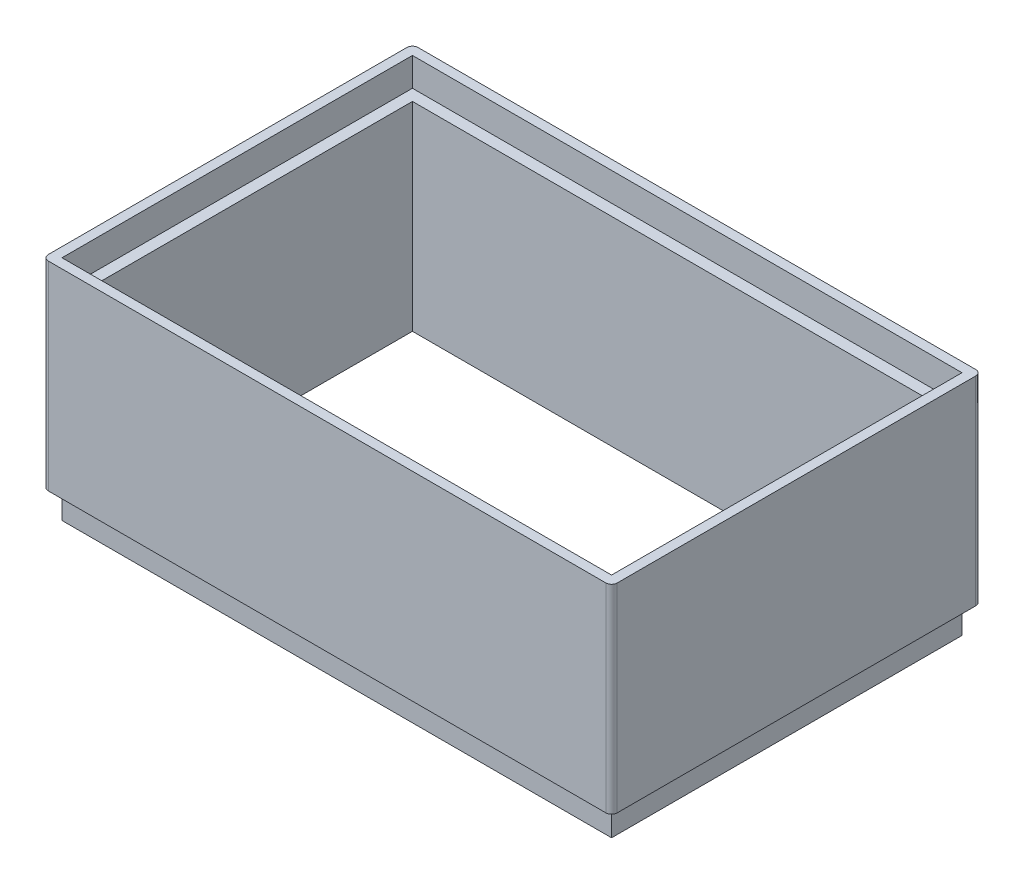
ISO-10303-21;
HEADER;
FILE_DESCRIPTION(('STEP AP214'),'2;1');
FILE_NAME('part.step','',(''),(''),'','','');
FILE_SCHEMA(('AUTOMOTIVE_DESIGN { 1 0 10303 214 1 1 1 1 }'));
ENDSEC;
DATA;
#1=APPLICATION_CONTEXT('core data for automotive mechanical design processes');
#2=APPLICATION_PROTOCOL_DEFINITION('international standard','automotive_design',2000,#1);
#3=PRODUCT_CONTEXT('',#1,'mechanical');
#4=PRODUCT('Part','Part','',(#3));
#5=PRODUCT_RELATED_PRODUCT_CATEGORY('part','',(#4));
#6=PRODUCT_DEFINITION_FORMATION('','',#4);
#7=PRODUCT_DEFINITION_CONTEXT('part definition',#1,'design');
#8=PRODUCT_DEFINITION('design','',#6,#7);
#9=PRODUCT_DEFINITION_SHAPE('','',#8);
#10=(LENGTH_UNIT() NAMED_UNIT(*) SI_UNIT(.MILLI.,.METRE.));
#11=(NAMED_UNIT(*) PLANE_ANGLE_UNIT() SI_UNIT($,.RADIAN.));
#12=(NAMED_UNIT(*) SI_UNIT($,.STERADIAN.) SOLID_ANGLE_UNIT());
#13=UNCERTAINTY_MEASURE_WITH_UNIT(LENGTH_MEASURE(1.E-05),#10,'distance_accuracy_value','');
#14=(GEOMETRIC_REPRESENTATION_CONTEXT(3) GLOBAL_UNCERTAINTY_ASSIGNED_CONTEXT((#13)) GLOBAL_UNIT_ASSIGNED_CONTEXT((#10,
#11,#12)) REPRESENTATION_CONTEXT('',''));
#15=CARTESIAN_POINT('',(0.,0.,0.));
#16=DIRECTION('',(0.,0.,1.));
#17=DIRECTION('',(1.,0.,0.));
#18=AXIS2_PLACEMENT_3D('',#15,#16,#17);
#19=CARTESIAN_POINT('',(47.5395437262358,80.002,-39.1555133079848));
#20=DIRECTION('',(0.,0.,-1.));
#21=DIRECTION('',(-1.,0.,0.));
#22=AXIS2_PLACEMENT_3D('',#19,#20,#21);
#23=PLANE('',#22);
#24=DIRECTION('',(1.,0.,0.));
#25=VECTOR('',#24,1.);
#26=CARTESIAN_POINT('',(47.5395437262358,70.,-39.1555133079848));
#27=LINE('',#26,#25);
#28=CARTESIAN_POINT('',(-45.0604562737642,70.,-39.1555133079848));
#29=VERTEX_POINT('',#28);
#30=CARTESIAN_POINT('',(47.5395437262358,70.,-39.1555133079848));
#31=VERTEX_POINT('',#30);
#32=EDGE_CURVE('E209',#29,#31,#27,.T.);
#33=ORIENTED_EDGE('',*,*,#32,.F.);
#34=DIRECTION('',(0.,-1.,0.));
#35=VECTOR('',#34,1.);
#36=CARTESIAN_POINT('',(-45.0604562737642,80.002,-39.1555133079848));
#37=LINE('',#36,#35);
#38=CARTESIAN_POINT('',(-45.0604562737642,35.,-39.1555133079848));
#39=VERTEX_POINT('',#38);
#40=EDGE_CURVE('E318',#29,#39,#37,.T.);
#41=ORIENTED_EDGE('',*,*,#40,.T.);
#42=DIRECTION('',(1.,0.,0.));
#43=VECTOR('',#42,1.);
#44=CARTESIAN_POINT('',(47.5395437262358,35.,-39.1555133079848));
#45=LINE('',#44,#43);
#46=CARTESIAN_POINT('',(47.5395437262358,35.,-39.1555133079848));
#47=VERTEX_POINT('',#46);
#48=EDGE_CURVE('E263',#39,#47,#45,.T.);
#49=ORIENTED_EDGE('',*,*,#48,.T.);
#50=DIRECTION('',(0.,-1.,0.));
#51=VECTOR('',#50,1.);
#52=CARTESIAN_POINT('',(47.5395437262358,80.002,-39.1555133079848));
#53=LINE('',#52,#51);
#54=EDGE_CURVE('E235',#31,#47,#53,.T.);
#55=ORIENTED_EDGE('',*,*,#54,.F.);
#56=EDGE_LOOP('',(#33,#41,#49,#55));
#57=FACE_BOUND('',#56,.T.);
#58=ADVANCED_FACE('F32',(#57),#23,.F.);
#59=CARTESIAN_POINT('',(-45.0604562737642,80.002,-39.1555133079848));
#60=DIRECTION('',(-1.,0.,0.));
#61=DIRECTION('',(0.,0.,1.));
#62=AXIS2_PLACEMENT_3D('',#59,#60,#61);
#63=PLANE('',#62);
#64=DIRECTION('',(0.,0.,-1.));
#65=VECTOR('',#64,1.);
#66=CARTESIAN_POINT('',(-45.0604562737642,70.,-39.1555133079848));
#67=LINE('',#66,#65);
#68=CARTESIAN_POINT('',(-45.0604562737642,70.,18.4444866920152));
#69=VERTEX_POINT('',#68);
#70=EDGE_CURVE('E207',#69,#29,#67,.T.);
#71=ORIENTED_EDGE('',*,*,#70,.F.);
#72=DIRECTION('',(0.,-1.,0.));
#73=VECTOR('',#72,1.);
#74=CARTESIAN_POINT('',(-45.0604562737642,80.002,18.4444866920152));
#75=LINE('',#74,#73);
#76=CARTESIAN_POINT('',(-45.0604562737642,35.,18.4444866920152));
#77=VERTEX_POINT('',#76);
#78=EDGE_CURVE('E320',#69,#77,#75,.T.);
#79=ORIENTED_EDGE('',*,*,#78,.T.);
#80=DIRECTION('',(0.,0.,-1.));
#81=VECTOR('',#80,1.);
#82=CARTESIAN_POINT('',(-45.0604562737642,35.,-39.1555133079848));
#83=LINE('',#82,#81);
#84=EDGE_CURVE('E273',#77,#39,#83,.T.);
#85=ORIENTED_EDGE('',*,*,#84,.T.);
#86=ORIENTED_EDGE('',*,*,#40,.F.);
#87=EDGE_LOOP('',(#71,#79,#85,#86));
#88=FACE_BOUND('',#87,.T.);
#89=ADVANCED_FACE('F337',(#88),#63,.F.);
#90=CARTESIAN_POINT('',(47.5395437262358,80.002,-39.1555133079848));
#91=DIRECTION('',(1.,0.,0.));
#92=DIRECTION('',(0.,0.,-1.));
#93=AXIS2_PLACEMENT_3D('',#90,#91,#92);
#94=PLANE('',#93);
#95=DIRECTION('',(0.,0.,1.));
#96=VECTOR('',#95,1.);
#97=CARTESIAN_POINT('',(47.5395437262358,70.,-39.1555133079848));
#98=LINE('',#97,#96);
#99=CARTESIAN_POINT('',(47.5395437262358,70.,18.4444866920152));
#100=VERTEX_POINT('',#99);
#101=EDGE_CURVE('E54',#31,#100,#98,.T.);
#102=ORIENTED_EDGE('',*,*,#101,.F.);
#103=ORIENTED_EDGE('',*,*,#54,.T.);
#104=DIRECTION('',(0.,0.,1.));
#105=VECTOR('',#104,1.);
#106=CARTESIAN_POINT('',(47.5395437262358,35.,-39.1555133079848));
#107=LINE('',#106,#105);
#108=CARTESIAN_POINT('',(47.5395437262358,35.,18.4444866920152));
#109=VERTEX_POINT('',#108);
#110=EDGE_CURVE('E40',#47,#109,#107,.T.);
#111=ORIENTED_EDGE('',*,*,#110,.T.);
#112=DIRECTION('',(0.,-1.,0.));
#113=VECTOR('',#112,1.);
#114=CARTESIAN_POINT('',(47.5395437262358,80.002,18.4444866920152));
#115=LINE('',#114,#113);
#116=EDGE_CURVE('E240',#100,#109,#115,.T.);
#117=ORIENTED_EDGE('',*,*,#116,.F.);
#118=EDGE_LOOP('',(#102,#103,#111,#117));
#119=FACE_BOUND('',#118,.T.);
#120=ADVANCED_FACE('F329',(#119),#94,.F.);
#121=CARTESIAN_POINT('',(47.5395437262358,80.002,18.4444866920152));
#122=DIRECTION('',(0.,0.,1.));
#123=DIRECTION('',(1.,0.,0.));
#124=AXIS2_PLACEMENT_3D('',#121,#122,#123);
#125=PLANE('',#124);
#126=DIRECTION('',(-1.,0.,0.));
#127=VECTOR('',#126,1.);
#128=CARTESIAN_POINT('',(47.5395437262358,70.,18.4444866920152));
#129=LINE('',#128,#127);
#130=EDGE_CURVE('E11',#100,#69,#129,.T.);
#131=ORIENTED_EDGE('',*,*,#130,.F.);
#132=ORIENTED_EDGE('',*,*,#116,.T.);
#133=DIRECTION('',(-1.,0.,0.));
#134=VECTOR('',#133,1.);
#135=CARTESIAN_POINT('',(47.5395437262358,35.,18.4444866920152));
#136=LINE('',#135,#134);
#137=EDGE_CURVE('E276',#109,#77,#136,.T.);
#138=ORIENTED_EDGE('',*,*,#137,.T.);
#139=ORIENTED_EDGE('',*,*,#78,.F.);
#140=EDGE_LOOP('',(#131,#132,#138,#139));
#141=FACE_BOUND('',#140,.T.);
#142=ADVANCED_FACE('F323',(#141),#125,.F.);
#143=CARTESIAN_POINT('',(0.,75.,0.));
#144=DIRECTION('',(0.,1.,0.));
#145=DIRECTION('',(0.,0.,1.));
#146=AXIS2_PLACEMENT_3D('',#143,#144,#145);
#147=PLANE('',#146);
#148=DIRECTION('',(0.,0.,1.));
#149=VECTOR('',#148,1.);
#150=CARTESIAN_POINT('',(-47.0604562737643,75.,-41.1555133079848));
#151=LINE('',#150,#149);
#152=CARTESIAN_POINT('',(-47.0604562737643,75.,-41.1555133079848));
#153=VERTEX_POINT('',#152);
#154=CARTESIAN_POINT('',(-47.0604562737643,75.,20.4444866920152));
#155=VERTEX_POINT('',#154);
#156=EDGE_CURVE('E47',#153,#155,#151,.T.);
#157=ORIENTED_EDGE('',*,*,#156,.F.);
#158=DIRECTION('',(-1.,0.,0.));
#159=VECTOR('',#158,1.);
#160=CARTESIAN_POINT('',(-47.0604562737643,75.,-41.1555133079848));
#161=LINE('',#160,#159);
#162=CARTESIAN_POINT('',(49.5395437262358,75.,-41.1555133079848));
#163=VERTEX_POINT('',#162);
#164=EDGE_CURVE('E188',#163,#153,#161,.T.);
#165=ORIENTED_EDGE('',*,*,#164,.F.);
#166=DIRECTION('',(0.,0.,-1.));
#167=VECTOR('',#166,1.);
#168=CARTESIAN_POINT('',(49.5395437262358,75.,-41.1555133079848));
#169=LINE('',#168,#167);
#170=CARTESIAN_POINT('',(49.5395437262358,75.,20.4444866920152));
#171=VERTEX_POINT('',#170);
#172=EDGE_CURVE('E191',#171,#163,#169,.T.);
#173=ORIENTED_EDGE('',*,*,#172,.F.);
#174=DIRECTION('',(1.,0.,0.));
#175=VECTOR('',#174,1.);
#176=CARTESIAN_POINT('',(-47.0604562737643,75.,20.4444866920152));
#177=LINE('',#176,#175);
#178=EDGE_CURVE('E197',#155,#171,#177,.T.);
#179=ORIENTED_EDGE('',*,*,#178,.F.);
#180=EDGE_LOOP('',(#157,#165,#173,#179));
#181=FACE_BOUND('',#180,.T.);
#182=CARTESIAN_POINT('',(-47.7604562737643,75.,21.1444866920152));
#183=DIRECTION('',(0.,1.,0.));
#184=DIRECTION('',(0.,0.,1.));
#185=AXIS2_PLACEMENT_3D('',#182,#183,#184);
#186=CIRCLE('',#185,1.);
#187=CARTESIAN_POINT('',(-47.7604562737643,75.,22.1444866920152));
#188=VERTEX_POINT('',#187);
#189=CARTESIAN_POINT('',(-48.7604562737643,75.,21.1444866920152));
#190=VERTEX_POINT('',#189);
#191=EDGE_CURVE('E286',#188,#190,#186,.F.);
#192=ORIENTED_EDGE('',*,*,#191,.F.);
#193=DIRECTION('',(1.,0.,0.));
#194=VECTOR('',#193,1.);
#195=CARTESIAN_POINT('',(-48.7604562737643,75.,22.1444866920152));
#196=LINE('',#195,#194);
#197=CARTESIAN_POINT('',(50.2395437262358,75.,22.1444866920152));
#198=VERTEX_POINT('',#197);
#199=EDGE_CURVE('E288',#188,#198,#196,.T.);
#200=ORIENTED_EDGE('',*,*,#199,.T.);
#201=CARTESIAN_POINT('',(50.2395437262358,75.,21.1444866920152));
#202=DIRECTION('',(0.,1.,0.));
#203=DIRECTION('',(0.,0.,1.));
#204=AXIS2_PLACEMENT_3D('',#201,#202,#203);
#205=CIRCLE('',#204,1.);
#206=CARTESIAN_POINT('',(51.2395437262358,75.,21.1444866920152));
#207=VERTEX_POINT('',#206);
#208=EDGE_CURVE('E282',#207,#198,#205,.F.);
#209=ORIENTED_EDGE('',*,*,#208,.F.);
#210=DIRECTION('',(0.,0.,-1.));
#211=VECTOR('',#210,1.);
#212=CARTESIAN_POINT('',(51.2395437262357,75.,-42.8555133079848));
#213=LINE('',#212,#211);
#214=CARTESIAN_POINT('',(51.2395437262357,75.,-41.8555133079848));
#215=VERTEX_POINT('',#214);
#216=EDGE_CURVE('E294',#207,#215,#213,.T.);
#217=ORIENTED_EDGE('',*,*,#216,.T.);
#218=CARTESIAN_POINT('',(50.2395437262357,75.,-41.8555133079848));
#219=DIRECTION('',(0.,1.,0.));
#220=DIRECTION('',(0.,0.,1.));
#221=AXIS2_PLACEMENT_3D('',#218,#219,#220);
#222=CIRCLE('',#221,1.);
#223=CARTESIAN_POINT('',(50.2395437262357,75.,-42.8555133079848));
#224=VERTEX_POINT('',#223);
#225=EDGE_CURVE('E215',#224,#215,#222,.F.);
#226=ORIENTED_EDGE('',*,*,#225,.F.);
#227=DIRECTION('',(-1.,0.,0.));
#228=VECTOR('',#227,1.);
#229=CARTESIAN_POINT('',(-48.7604562737643,75.,-42.8555133079848));
#230=LINE('',#229,#228);
#231=CARTESIAN_POINT('',(-47.7604562737643,75.,-42.8555133079848));
#232=VERTEX_POINT('',#231);
#233=EDGE_CURVE('E211',#224,#232,#230,.T.);
#234=ORIENTED_EDGE('',*,*,#233,.T.);
#235=CARTESIAN_POINT('',(-47.7604562737643,75.,-41.8555133079848));
#236=DIRECTION('',(0.,1.,0.));
#237=DIRECTION('',(0.,0.,1.));
#238=AXIS2_PLACEMENT_3D('',#235,#236,#237);
#239=CIRCLE('',#238,1.);
#240=CARTESIAN_POINT('',(-48.7604562737643,75.,-41.8555133079848));
#241=VERTEX_POINT('',#240);
#242=EDGE_CURVE('E284',#241,#232,#239,.F.);
#243=ORIENTED_EDGE('',*,*,#242,.F.);
#244=DIRECTION('',(0.,0.,1.));
#245=VECTOR('',#244,1.);
#246=CARTESIAN_POINT('',(-48.7604562737643,75.,-42.8555133079848));
#247=LINE('',#246,#245);
#248=EDGE_CURVE('E291',#241,#190,#247,.T.);
#249=ORIENTED_EDGE('',*,*,#248,.T.);
#250=EDGE_LOOP('',(#192,#200,#209,#217,#226,#234,#243,#249));
#251=FACE_BOUND('',#250,.T.);
#252=ADVANCED_FACE('F351',(#181,#251),#147,.T.);
#253=CARTESIAN_POINT('',(-47.0604562737643,35.,-41.1555133079848));
#254=DIRECTION('',(0.,0.,1.));
#255=DIRECTION('',(1.,0.,0.));
#256=AXIS2_PLACEMENT_3D('',#253,#254,#255);
#257=PLANE('',#256);
#258=DIRECTION('',(1.,0.,0.));
#259=VECTOR('',#258,1.);
#260=CARTESIAN_POINT('',(-47.0604562737643,40.,-41.1555133079848));
#261=LINE('',#260,#259);
#262=CARTESIAN_POINT('',(-47.0604562737643,40.,-41.1555133079848));
#263=VERTEX_POINT('',#262);
#264=CARTESIAN_POINT('',(49.5395437262358,40.,-41.1555133079848));
#265=VERTEX_POINT('',#264);
#266=EDGE_CURVE('E257',#263,#265,#261,.T.);
#267=ORIENTED_EDGE('',*,*,#266,.T.);
#268=DIRECTION('',(0.,1.,0.));
#269=VECTOR('',#268,1.);
#270=CARTESIAN_POINT('',(49.5395437262358,35.,-41.1555133079848));
#271=LINE('',#270,#269);
#272=CARTESIAN_POINT('',(49.5395437262358,35.,-41.1555133079848));
#273=VERTEX_POINT('',#272);
#274=EDGE_CURVE('E239',#273,#265,#271,.T.);
#275=ORIENTED_EDGE('',*,*,#274,.F.);
#276=DIRECTION('',(1.,0.,0.));
#277=VECTOR('',#276,1.);
#278=CARTESIAN_POINT('',(-47.0604562737643,35.,-41.1555133079848));
#279=LINE('',#278,#277);
#280=CARTESIAN_POINT('',(-47.0604562737643,35.,-41.1555133079848));
#281=VERTEX_POINT('',#280);
#282=EDGE_CURVE('E267',#281,#273,#279,.T.);
#283=ORIENTED_EDGE('',*,*,#282,.F.);
#284=DIRECTION('',(0.,1.,0.));
#285=VECTOR('',#284,1.);
#286=CARTESIAN_POINT('',(-47.0604562737643,35.,-41.1555133079848));
#287=LINE('',#286,#285);
#288=EDGE_CURVE('E236',#281,#263,#287,.T.);
#289=ORIENTED_EDGE('',*,*,#288,.T.);
#290=EDGE_LOOP('',(#267,#275,#283,#289));
#291=FACE_BOUND('',#290,.T.);
#292=ADVANCED_FACE('F352',(#291),#257,.F.);
#293=CARTESIAN_POINT('',(49.5395437262358,35.,20.4444866920152));
#294=DIRECTION('',(-1.,0.,0.));
#295=DIRECTION('',(0.,0.,1.));
#296=AXIS2_PLACEMENT_3D('',#293,#294,#295);
#297=PLANE('',#296);
#298=DIRECTION('',(0.,0.,1.));
#299=VECTOR('',#298,1.);
#300=CARTESIAN_POINT('',(49.5395437262358,40.,20.4444866920152));
#301=LINE('',#300,#299);
#302=CARTESIAN_POINT('',(49.5395437262358,40.,20.4444866920152));
#303=VERTEX_POINT('',#302);
#304=EDGE_CURVE('E253',#265,#303,#301,.T.);
#305=ORIENTED_EDGE('',*,*,#304,.T.);
#306=DIRECTION('',(0.,1.,0.));
#307=VECTOR('',#306,1.);
#308=CARTESIAN_POINT('',(49.5395437262358,35.,20.4444866920152));
#309=LINE('',#308,#307);
#310=CARTESIAN_POINT('',(49.5395437262358,35.,20.4444866920152));
#311=VERTEX_POINT('',#310);
#312=EDGE_CURVE('E243',#311,#303,#309,.T.);
#313=ORIENTED_EDGE('',*,*,#312,.F.);
#314=DIRECTION('',(0.,0.,1.));
#315=VECTOR('',#314,1.);
#316=CARTESIAN_POINT('',(49.5395437262358,35.,20.4444866920152));
#317=LINE('',#316,#315);
#318=EDGE_CURVE('E265',#273,#311,#317,.T.);
#319=ORIENTED_EDGE('',*,*,#318,.F.);
#320=ORIENTED_EDGE('',*,*,#274,.T.);
#321=EDGE_LOOP('',(#305,#313,#319,#320));
#322=FACE_BOUND('',#321,.T.);
#323=ADVANCED_FACE('F419',(#322),#297,.F.);
#324=CARTESIAN_POINT('',(-47.0604562737643,35.,20.4444866920152));
#325=DIRECTION('',(0.,0.,-1.));
#326=DIRECTION('',(-1.,0.,0.));
#327=AXIS2_PLACEMENT_3D('',#324,#325,#326);
#328=PLANE('',#327);
#329=DIRECTION('',(-1.,0.,0.));
#330=VECTOR('',#329,1.);
#331=CARTESIAN_POINT('',(-47.0604562737643,40.,20.4444866920152));
#332=LINE('',#331,#330);
#333=CARTESIAN_POINT('',(-47.0604562737643,40.,20.4444866920152));
#334=VERTEX_POINT('',#333);
#335=EDGE_CURVE('E250',#303,#334,#332,.T.);
#336=ORIENTED_EDGE('',*,*,#335,.T.);
#337=DIRECTION('',(0.,1.,0.));
#338=VECTOR('',#337,1.);
#339=CARTESIAN_POINT('',(-47.0604562737643,35.,20.4444866920152));
#340=LINE('',#339,#338);
#341=CARTESIAN_POINT('',(-47.0604562737643,35.,20.4444866920152));
#342=VERTEX_POINT('',#341);
#343=EDGE_CURVE('E246',#342,#334,#340,.T.);
#344=ORIENTED_EDGE('',*,*,#343,.F.);
#345=DIRECTION('',(-1.,0.,0.));
#346=VECTOR('',#345,1.);
#347=CARTESIAN_POINT('',(-47.0604562737643,35.,20.4444866920152));
#348=LINE('',#347,#346);
#349=EDGE_CURVE('E249',#311,#342,#348,.T.);
#350=ORIENTED_EDGE('',*,*,#349,.F.);
#351=ORIENTED_EDGE('',*,*,#312,.T.);
#352=EDGE_LOOP('',(#336,#344,#350,#351));
#353=FACE_BOUND('',#352,.T.);
#354=ADVANCED_FACE('F416',(#353),#328,.F.);
#355=CARTESIAN_POINT('',(-47.0604562737643,35.,20.4444866920152));
#356=DIRECTION('',(1.,0.,0.));
#357=DIRECTION('',(0.,0.,-1.));
#358=AXIS2_PLACEMENT_3D('',#355,#356,#357);
#359=PLANE('',#358);
#360=DIRECTION('',(0.,0.,-1.));
#361=VECTOR('',#360,1.);
#362=CARTESIAN_POINT('',(-47.0604562737643,40.,20.4444866920152));
#363=LINE('',#362,#361);
#364=EDGE_CURVE('E260',#334,#263,#363,.T.);
#365=ORIENTED_EDGE('',*,*,#364,.T.);
#366=ORIENTED_EDGE('',*,*,#288,.F.);
#367=DIRECTION('',(0.,0.,-1.));
#368=VECTOR('',#367,1.);
#369=CARTESIAN_POINT('',(-47.0604562737643,35.,20.4444866920152));
#370=LINE('',#369,#368);
#371=EDGE_CURVE('E254',#342,#281,#370,.T.);
#372=ORIENTED_EDGE('',*,*,#371,.F.);
#373=ORIENTED_EDGE('',*,*,#343,.T.);
#374=EDGE_LOOP('',(#365,#366,#372,#373));
#375=FACE_BOUND('',#374,.T.);
#376=ADVANCED_FACE('F409',(#375),#359,.F.);
#377=CARTESIAN_POINT('',(-48.7604562737643,80.,22.1444866920152));
#378=DIRECTION('',(0.,0.,-1.));
#379=DIRECTION('',(-1.,0.,0.));
#380=AXIS2_PLACEMENT_3D('',#377,#378,#379);
#381=PLANE('',#380);
#382=ORIENTED_EDGE('',*,*,#199,.F.);
#383=DIRECTION('',(0.,-1.,0.));
#384=VECTOR('',#383,1.);
#385=CARTESIAN_POINT('',(-47.7604562737643,80.,22.1444866920152));
#386=LINE('',#385,#384);
#387=CARTESIAN_POINT('',(-47.7604562737643,40.,22.1444866920152));
#388=VERTEX_POINT('',#387);
#389=EDGE_CURVE('E301',#188,#388,#386,.T.);
#390=ORIENTED_EDGE('',*,*,#389,.T.);
#391=DIRECTION('',(1.,0.,0.));
#392=VECTOR('',#391,1.);
#393=CARTESIAN_POINT('',(-48.7604562737643,40.,22.1444866920152));
#394=LINE('',#393,#392);
#395=CARTESIAN_POINT('',(50.2395437262358,40.,22.1444866920152));
#396=VERTEX_POINT('',#395);
#397=EDGE_CURVE('E225',#388,#396,#394,.T.);
#398=ORIENTED_EDGE('',*,*,#397,.T.);
#399=DIRECTION('',(0.,-1.,0.));
#400=VECTOR('',#399,1.);
#401=CARTESIAN_POINT('',(50.2395437262358,80.,22.1444866920152));
#402=LINE('',#401,#400);
#403=EDGE_CURVE('E221',#396,#198,#402,.F.);
#404=ORIENTED_EDGE('',*,*,#403,.T.);
#405=EDGE_LOOP('',(#382,#390,#398,#404));
#406=FACE_BOUND('',#405,.T.);
#407=ADVANCED_FACE('F392',(#406),#381,.F.);
#408=CARTESIAN_POINT('',(0.,40.,0.));
#409=DIRECTION('',(0.,1.,0.));
#410=DIRECTION('',(0.,0.,1.));
#411=AXIS2_PLACEMENT_3D('',#408,#409,#410);
#412=PLANE('',#411);
#413=DIRECTION('',(0.,0.,-1.));
#414=VECTOR('',#413,1.);
#415=CARTESIAN_POINT('',(51.2395437262357,40.,-42.8555133079848));
#416=LINE('',#415,#414);
#417=CARTESIAN_POINT('',(51.2395437262358,40.,21.1444866920152));
#418=VERTEX_POINT('',#417);
#419=CARTESIAN_POINT('',(51.2395437262357,40.,-41.8555133079848));
#420=VERTEX_POINT('',#419);
#421=EDGE_CURVE('E229',#418,#420,#416,.T.);
#422=ORIENTED_EDGE('',*,*,#421,.F.);
#423=CARTESIAN_POINT('',(50.2395437262358,40.,21.1444866920152));
#424=DIRECTION('',(0.,1.,0.));
#425=DIRECTION('',(0.,0.,1.));
#426=AXIS2_PLACEMENT_3D('',#423,#424,#425);
#427=CIRCLE('',#426,1.);
#428=EDGE_CURVE('E212',#418,#396,#427,.F.);
#429=ORIENTED_EDGE('',*,*,#428,.T.);
#430=ORIENTED_EDGE('',*,*,#397,.F.);
#431=CARTESIAN_POINT('',(-47.7604562737643,40.,21.1444866920152));
#432=DIRECTION('',(0.,1.,0.));
#433=DIRECTION('',(0.,0.,1.));
#434=AXIS2_PLACEMENT_3D('',#431,#432,#433);
#435=CIRCLE('',#434,1.);
#436=CARTESIAN_POINT('',(-48.7604562737643,40.,21.1444866920152));
#437=VERTEX_POINT('',#436);
#438=EDGE_CURVE('E214',#388,#437,#435,.F.);
#439=ORIENTED_EDGE('',*,*,#438,.T.);
#440=DIRECTION('',(0.,0.,1.));
#441=VECTOR('',#440,1.);
#442=CARTESIAN_POINT('',(-48.7604562737643,40.,-42.8555133079848));
#443=LINE('',#442,#441);
#444=CARTESIAN_POINT('',(-48.7604562737643,40.,-41.8555133079848));
#445=VERTEX_POINT('',#444);
#446=EDGE_CURVE('E222',#445,#437,#443,.T.);
#447=ORIENTED_EDGE('',*,*,#446,.F.);
#448=CARTESIAN_POINT('',(-47.7604562737643,40.,-41.8555133079848));
#449=DIRECTION('',(0.,1.,0.));
#450=DIRECTION('',(0.,0.,1.));
#451=AXIS2_PLACEMENT_3D('',#448,#449,#450);
#452=CIRCLE('',#451,1.);
#453=CARTESIAN_POINT('',(-47.7604562737643,40.,-42.8555133079848));
#454=VERTEX_POINT('',#453);
#455=EDGE_CURVE('E217',#445,#454,#452,.F.);
#456=ORIENTED_EDGE('',*,*,#455,.T.);
#457=DIRECTION('',(-1.,0.,0.));
#458=VECTOR('',#457,1.);
#459=CARTESIAN_POINT('',(-48.7604562737643,40.,-42.8555133079848));
#460=LINE('',#459,#458);
#461=CARTESIAN_POINT('',(50.2395437262357,40.,-42.8555133079848));
#462=VERTEX_POINT('',#461);
#463=EDGE_CURVE('E232',#462,#454,#460,.T.);
#464=ORIENTED_EDGE('',*,*,#463,.F.);
#465=CARTESIAN_POINT('',(50.2395437262357,40.,-41.8555133079848));
#466=DIRECTION('',(0.,1.,0.));
#467=DIRECTION('',(0.,0.,1.));
#468=AXIS2_PLACEMENT_3D('',#465,#466,#467);
#469=CIRCLE('',#468,1.);
#470=EDGE_CURVE('E219',#462,#420,#469,.F.);
#471=ORIENTED_EDGE('',*,*,#470,.T.);
#472=EDGE_LOOP('',(#422,#429,#430,#439,#447,#456,#464,#471));
#473=FACE_BOUND('',#472,.T.);
#474=ORIENTED_EDGE('',*,*,#364,.F.);
#475=ORIENTED_EDGE('',*,*,#335,.F.);
#476=ORIENTED_EDGE('',*,*,#304,.F.);
#477=ORIENTED_EDGE('',*,*,#266,.F.);
#478=EDGE_LOOP('',(#474,#475,#476,#477));
#479=FACE_BOUND('',#478,.T.);
#480=ADVANCED_FACE('F381',(#473,#479),#412,.F.);
#481=CARTESIAN_POINT('',(51.2395437262357,80.,-42.8555133079848));
#482=DIRECTION('',(-1.,0.,0.));
#483=DIRECTION('',(0.,0.,1.));
#484=AXIS2_PLACEMENT_3D('',#481,#482,#483);
#485=PLANE('',#484);
#486=ORIENTED_EDGE('',*,*,#216,.F.);
#487=DIRECTION('',(0.,-1.,0.));
#488=VECTOR('',#487,1.);
#489=CARTESIAN_POINT('',(51.2395437262358,80.,21.1444866920152));
#490=LINE('',#489,#488);
#491=EDGE_CURVE('E313',#207,#418,#490,.T.);
#492=ORIENTED_EDGE('',*,*,#491,.T.);
#493=ORIENTED_EDGE('',*,*,#421,.T.);
#494=DIRECTION('',(0.,-1.,0.));
#495=VECTOR('',#494,1.);
#496=CARTESIAN_POINT('',(51.2395437262357,80.,-41.8555133079848));
#497=LINE('',#496,#495);
#498=EDGE_CURVE('E226',#420,#215,#497,.F.);
#499=ORIENTED_EDGE('',*,*,#498,.T.);
#500=EDGE_LOOP('',(#486,#492,#493,#499));
#501=FACE_BOUND('',#500,.T.);
#502=ADVANCED_FACE('F378',(#501),#485,.F.);
#503=CARTESIAN_POINT('',(-48.7604562737643,80.,-42.8555133079848));
#504=DIRECTION('',(0.,0.,1.));
#505=DIRECTION('',(1.,0.,0.));
#506=AXIS2_PLACEMENT_3D('',#503,#504,#505);
#507=PLANE('',#506);
#508=ORIENTED_EDGE('',*,*,#233,.F.);
#509=DIRECTION('',(0.,-1.,0.));
#510=VECTOR('',#509,1.);
#511=CARTESIAN_POINT('',(50.2395437262357,80.,-42.8555133079848));
#512=LINE('',#511,#510);
#513=EDGE_CURVE('E311',#224,#462,#512,.T.);
#514=ORIENTED_EDGE('',*,*,#513,.T.);
#515=ORIENTED_EDGE('',*,*,#463,.T.);
#516=DIRECTION('',(0.,-1.,0.));
#517=VECTOR('',#516,1.);
#518=CARTESIAN_POINT('',(-47.7604562737643,80.,-42.8555133079848));
#519=LINE('',#518,#517);
#520=EDGE_CURVE('E308',#454,#232,#519,.F.);
#521=ORIENTED_EDGE('',*,*,#520,.T.);
#522=EDGE_LOOP('',(#508,#514,#515,#521));
#523=FACE_BOUND('',#522,.T.);
#524=ADVANCED_FACE('F370',(#523),#507,.F.);
#525=CARTESIAN_POINT('',(50.2395437262357,80.,-41.8555133079848));
#526=DIRECTION('',(0.,-1.,0.));
#527=DIRECTION('',(0.,0.,-1.));
#528=AXIS2_PLACEMENT_3D('',#525,#526,#527);
#529=CYLINDRICAL_SURFACE('',#528,1.);
#530=ORIENTED_EDGE('',*,*,#513,.F.);
#531=ORIENTED_EDGE('',*,*,#225,.T.);
#532=ORIENTED_EDGE('',*,*,#498,.F.);
#533=ORIENTED_EDGE('',*,*,#470,.F.);
#534=EDGE_LOOP('',(#530,#531,#532,#533));
#535=FACE_BOUND('',#534,.T.);
#536=ADVANCED_FACE('F34',(#535),#529,.T.);
#537=CARTESIAN_POINT('',(50.2395437262358,80.,21.1444866920152));
#538=DIRECTION('',(0.,-1.,0.));
#539=DIRECTION('',(0.,0.,-1.));
#540=AXIS2_PLACEMENT_3D('',#537,#538,#539);
#541=CYLINDRICAL_SURFACE('',#540,1.);
#542=ORIENTED_EDGE('',*,*,#491,.F.);
#543=ORIENTED_EDGE('',*,*,#208,.T.);
#544=ORIENTED_EDGE('',*,*,#403,.F.);
#545=ORIENTED_EDGE('',*,*,#428,.F.);
#546=EDGE_LOOP('',(#542,#543,#544,#545));
#547=FACE_BOUND('',#546,.T.);
#548=ADVANCED_FACE('F361',(#547),#541,.T.);
#549=CARTESIAN_POINT('',(-48.7604562737643,80.,-42.8555133079848));
#550=DIRECTION('',(1.,0.,0.));
#551=DIRECTION('',(0.,0.,-1.));
#552=AXIS2_PLACEMENT_3D('',#549,#550,#551);
#553=PLANE('',#552);
#554=ORIENTED_EDGE('',*,*,#248,.F.);
#555=DIRECTION('',(0.,-1.,0.));
#556=VECTOR('',#555,1.);
#557=CARTESIAN_POINT('',(-48.7604562737643,80.,-41.8555133079848));
#558=LINE('',#557,#556);
#559=EDGE_CURVE('E306',#241,#445,#558,.T.);
#560=ORIENTED_EDGE('',*,*,#559,.T.);
#561=ORIENTED_EDGE('',*,*,#446,.T.);
#562=DIRECTION('',(0.,-1.,0.));
#563=VECTOR('',#562,1.);
#564=CARTESIAN_POINT('',(-48.7604562737643,80.,21.1444866920152));
#565=LINE('',#564,#563);
#566=EDGE_CURVE('E303',#437,#190,#565,.F.);
#567=ORIENTED_EDGE('',*,*,#566,.T.);
#568=EDGE_LOOP('',(#554,#560,#561,#567));
#569=FACE_BOUND('',#568,.T.);
#570=ADVANCED_FACE('F359',(#569),#553,.F.);
#571=CARTESIAN_POINT('',(-47.7604562737643,80.,-41.8555133079848));
#572=DIRECTION('',(0.,-1.,0.));
#573=DIRECTION('',(0.,0.,-1.));
#574=AXIS2_PLACEMENT_3D('',#571,#572,#573);
#575=CYLINDRICAL_SURFACE('',#574,1.);
#576=ORIENTED_EDGE('',*,*,#559,.F.);
#577=ORIENTED_EDGE('',*,*,#242,.T.);
#578=ORIENTED_EDGE('',*,*,#520,.F.);
#579=ORIENTED_EDGE('',*,*,#455,.F.);
#580=EDGE_LOOP('',(#576,#577,#578,#579));
#581=FACE_BOUND('',#580,.T.);
#582=ADVANCED_FACE('F356',(#581),#575,.T.);
#583=CARTESIAN_POINT('',(-47.7604562737643,80.,21.1444866920152));
#584=DIRECTION('',(0.,-1.,0.));
#585=DIRECTION('',(0.,0.,-1.));
#586=AXIS2_PLACEMENT_3D('',#583,#584,#585);
#587=CYLINDRICAL_SURFACE('',#586,1.);
#588=ORIENTED_EDGE('',*,*,#389,.F.);
#589=ORIENTED_EDGE('',*,*,#191,.T.);
#590=ORIENTED_EDGE('',*,*,#566,.F.);
#591=ORIENTED_EDGE('',*,*,#438,.F.);
#592=EDGE_LOOP('',(#588,#589,#590,#591));
#593=FACE_BOUND('',#592,.T.);
#594=ADVANCED_FACE('F353',(#593),#587,.T.);
#595=CARTESIAN_POINT('',(0.,35.,0.));
#596=DIRECTION('',(0.,-1.,0.));
#597=DIRECTION('',(0.,0.,-1.));
#598=AXIS2_PLACEMENT_3D('',#595,#596,#597);
#599=PLANE('',#598);
#600=ORIENTED_EDGE('',*,*,#371,.T.);
#601=ORIENTED_EDGE('',*,*,#282,.T.);
#602=ORIENTED_EDGE('',*,*,#318,.T.);
#603=ORIENTED_EDGE('',*,*,#349,.T.);
#604=EDGE_LOOP('',(#600,#601,#602,#603));
#605=FACE_BOUND('',#604,.T.);
#606=ORIENTED_EDGE('',*,*,#137,.F.);
#607=ORIENTED_EDGE('',*,*,#110,.F.);
#608=ORIENTED_EDGE('',*,*,#48,.F.);
#609=ORIENTED_EDGE('',*,*,#84,.F.);
#610=EDGE_LOOP('',(#606,#607,#608,#609));
#611=FACE_BOUND('',#610,.T.);
#612=ADVANCED_FACE('F333',(#605,#611),#599,.T.);
#613=CARTESIAN_POINT('',(0.,70.,0.));
#614=DIRECTION('',(0.,1.,0.));
#615=DIRECTION('',(0.,0.,1.));
#616=AXIS2_PLACEMENT_3D('',#613,#614,#615);
#617=PLANE('',#616);
#618=DIRECTION('',(0.,0.,1.));
#619=VECTOR('',#618,1.);
#620=CARTESIAN_POINT('',(-47.0604562737643,70.,-41.1555133079848));
#621=LINE('',#620,#619);
#622=CARTESIAN_POINT('',(-47.0604562737643,70.,-41.1555133079848));
#623=VERTEX_POINT('',#622);
#624=CARTESIAN_POINT('',(-47.0604562737643,70.,20.4444866920152));
#625=VERTEX_POINT('',#624);
#626=EDGE_CURVE('E170',#623,#625,#621,.T.);
#627=ORIENTED_EDGE('',*,*,#626,.T.);
#628=DIRECTION('',(1.,0.,0.));
#629=VECTOR('',#628,1.);
#630=CARTESIAN_POINT('',(-47.0604562737643,70.,20.4444866920152));
#631=LINE('',#630,#629);
#632=CARTESIAN_POINT('',(49.5395437262358,70.,20.4444866920152));
#633=VERTEX_POINT('',#632);
#634=EDGE_CURVE('E179',#625,#633,#631,.T.);
#635=ORIENTED_EDGE('',*,*,#634,.T.);
#636=DIRECTION('',(0.,0.,-1.));
#637=VECTOR('',#636,1.);
#638=CARTESIAN_POINT('',(49.5395437262358,70.,-41.1555133079848));
#639=LINE('',#638,#637);
#640=CARTESIAN_POINT('',(49.5395437262358,70.,-41.1555133079848));
#641=VERTEX_POINT('',#640);
#642=EDGE_CURVE('E184',#633,#641,#639,.T.);
#643=ORIENTED_EDGE('',*,*,#642,.T.);
#644=DIRECTION('',(-1.,0.,0.));
#645=VECTOR('',#644,1.);
#646=CARTESIAN_POINT('',(-47.0604562737643,70.,-41.1555133079848));
#647=LINE('',#646,#645);
#648=EDGE_CURVE('E176',#641,#623,#647,.T.);
#649=ORIENTED_EDGE('',*,*,#648,.T.);
#650=EDGE_LOOP('',(#627,#635,#643,#649));
#651=FACE_BOUND('',#650,.T.);
#652=ORIENTED_EDGE('',*,*,#32,.T.);
#653=ORIENTED_EDGE('',*,*,#101,.T.);
#654=ORIENTED_EDGE('',*,*,#130,.T.);
#655=ORIENTED_EDGE('',*,*,#70,.T.);
#656=EDGE_LOOP('',(#652,#653,#654,#655));
#657=FACE_BOUND('',#656,.T.);
#658=ADVANCED_FACE('F186',(#651,#657),#617,.T.);
#659=CARTESIAN_POINT('',(-47.0604562737643,70.,-41.1555133079848));
#660=DIRECTION('',(-1.,0.,0.));
#661=DIRECTION('',(0.,0.,1.));
#662=AXIS2_PLACEMENT_3D('',#659,#660,#661);
#663=PLANE('',#662);
#664=ORIENTED_EDGE('',*,*,#156,.T.);
#665=DIRECTION('',(0.,1.,0.));
#666=VECTOR('',#665,1.);
#667=CARTESIAN_POINT('',(-47.0604562737643,70.,20.4444866920152));
#668=LINE('',#667,#666);
#669=EDGE_CURVE('E166',#625,#155,#668,.T.);
#670=ORIENTED_EDGE('',*,*,#669,.F.);
#671=ORIENTED_EDGE('',*,*,#626,.F.);
#672=DIRECTION('',(0.,1.,0.));
#673=VECTOR('',#672,1.);
#674=CARTESIAN_POINT('',(-47.0604562737643,70.,-41.1555133079848));
#675=LINE('',#674,#673);
#676=EDGE_CURVE('E201',#623,#153,#675,.T.);
#677=ORIENTED_EDGE('',*,*,#676,.T.);
#678=EDGE_LOOP('',(#664,#670,#671,#677));
#679=FACE_BOUND('',#678,.T.);
#680=ADVANCED_FACE('F168',(#679),#663,.F.);
#681=CARTESIAN_POINT('',(-47.0604562737643,70.,-41.1555133079848));
#682=DIRECTION('',(0.,0.,-1.));
#683=DIRECTION('',(-1.,0.,0.));
#684=AXIS2_PLACEMENT_3D('',#681,#682,#683);
#685=PLANE('',#684);
#686=ORIENTED_EDGE('',*,*,#164,.T.);
#687=ORIENTED_EDGE('',*,*,#676,.F.);
#688=ORIENTED_EDGE('',*,*,#648,.F.);
#689=DIRECTION('',(0.,1.,0.));
#690=VECTOR('',#689,1.);
#691=CARTESIAN_POINT('',(49.5395437262358,70.,-41.1555133079848));
#692=LINE('',#691,#690);
#693=EDGE_CURVE('E203',#641,#163,#692,.T.);
#694=ORIENTED_EDGE('',*,*,#693,.T.);
#695=EDGE_LOOP('',(#686,#687,#688,#694));
#696=FACE_BOUND('',#695,.T.);
#697=ADVANCED_FACE('F434',(#696),#685,.F.);
#698=CARTESIAN_POINT('',(49.5395437262358,70.,-41.1555133079848));
#699=DIRECTION('',(1.,0.,0.));
#700=DIRECTION('',(0.,0.,-1.));
#701=AXIS2_PLACEMENT_3D('',#698,#699,#700);
#702=PLANE('',#701);
#703=ORIENTED_EDGE('',*,*,#172,.T.);
#704=ORIENTED_EDGE('',*,*,#693,.F.);
#705=ORIENTED_EDGE('',*,*,#642,.F.);
#706=DIRECTION('',(0.,1.,0.));
#707=VECTOR('',#706,1.);
#708=CARTESIAN_POINT('',(49.5395437262358,70.,20.4444866920152));
#709=LINE('',#708,#707);
#710=EDGE_CURVE('E175',#633,#171,#709,.T.);
#711=ORIENTED_EDGE('',*,*,#710,.T.);
#712=EDGE_LOOP('',(#703,#704,#705,#711));
#713=FACE_BOUND('',#712,.T.);
#714=ADVANCED_FACE('F437',(#713),#702,.F.);
#715=CARTESIAN_POINT('',(-47.0604562737643,70.,20.4444866920152));
#716=DIRECTION('',(0.,0.,1.));
#717=DIRECTION('',(1.,0.,0.));
#718=AXIS2_PLACEMENT_3D('',#715,#716,#717);
#719=PLANE('',#718);
#720=ORIENTED_EDGE('',*,*,#178,.T.);
#721=ORIENTED_EDGE('',*,*,#710,.F.);
#722=ORIENTED_EDGE('',*,*,#634,.F.);
#723=ORIENTED_EDGE('',*,*,#669,.T.);
#724=EDGE_LOOP('',(#720,#721,#722,#723));
#725=FACE_BOUND('',#724,.T.);
#726=ADVANCED_FACE('F180',(#725),#719,.F.);
#727=CLOSED_SHELL('',(#58,#89,#120,#142,#252,#292,#323,#354,#376,#407,#480,#502,#524,#536,#548,
#570,#582,#594,#612,#658,#680,#697,#714,#726));
#728=MANIFOLD_SOLID_BREP('B2',#727);
#729=ADVANCED_BREP_SHAPE_REPRESENTATION('',(#18,#728),#14);
#730=SHAPE_DEFINITION_REPRESENTATION(#9,#729);
ENDSEC;
END-ISO-10303-21;
